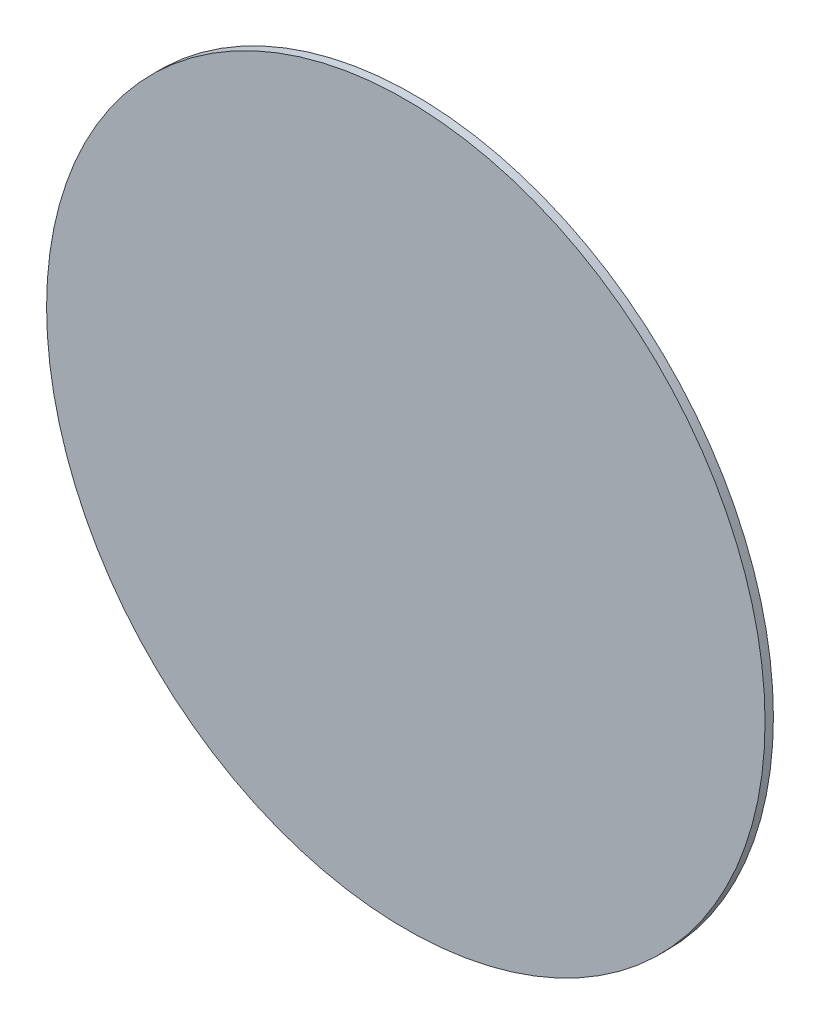
ISO-10303-21;
HEADER;
FILE_DESCRIPTION(('STEP AP214'),'2;1');
FILE_NAME('part.step','',(''),(''),'','','');
FILE_SCHEMA(('AUTOMOTIVE_DESIGN { 1 0 10303 214 1 1 1 1 }'));
ENDSEC;
DATA;
#1=APPLICATION_CONTEXT('core data for automotive mechanical design processes');
#2=APPLICATION_PROTOCOL_DEFINITION('international standard','automotive_design',2000,#1);
#3=PRODUCT_CONTEXT('',#1,'mechanical');
#4=PRODUCT('Part','Part','',(#3));
#5=PRODUCT_RELATED_PRODUCT_CATEGORY('part','',(#4));
#6=PRODUCT_DEFINITION_FORMATION('','',#4);
#7=PRODUCT_DEFINITION_CONTEXT('part definition',#1,'design');
#8=PRODUCT_DEFINITION('design','',#6,#7);
#9=PRODUCT_DEFINITION_SHAPE('','',#8);
#10=(LENGTH_UNIT() NAMED_UNIT(*) SI_UNIT(.MILLI.,.METRE.));
#11=(NAMED_UNIT(*) PLANE_ANGLE_UNIT() SI_UNIT($,.RADIAN.));
#12=(NAMED_UNIT(*) SI_UNIT($,.STERADIAN.) SOLID_ANGLE_UNIT());
#13=UNCERTAINTY_MEASURE_WITH_UNIT(LENGTH_MEASURE(1.E-05),#10,'distance_accuracy_value','');
#14=(GEOMETRIC_REPRESENTATION_CONTEXT(3) GLOBAL_UNCERTAINTY_ASSIGNED_CONTEXT((#13)) GLOBAL_UNIT_ASSIGNED_CONTEXT((#10,
#11,#12)) REPRESENTATION_CONTEXT('',''));
#15=CARTESIAN_POINT('',(0.,0.,0.));
#16=DIRECTION('',(0.,0.,1.));
#17=DIRECTION('',(1.,0.,0.));
#18=AXIS2_PLACEMENT_3D('',#15,#16,#17);
#19=CARTESIAN_POINT('',(0.,0.,2.5));
#20=DIRECTION('',(0.,0.,-1.));
#21=DIRECTION('',(-1.,0.,0.));
#22=AXIS2_PLACEMENT_3D('',#19,#20,#21);
#23=CYLINDRICAL_SURFACE('',#22,107.5);
#24=CARTESIAN_POINT('',(0.,0.,2.5));
#25=DIRECTION('',(0.,0.,1.));
#26=DIRECTION('',(1.,0.,0.));
#27=AXIS2_PLACEMENT_3D('',#24,#25,#26);
#28=CIRCLE('',#27,107.5);
#29=CARTESIAN_POINT('',(107.5,0.,2.5));
#30=VERTEX_POINT('',#29);
#31=EDGE_CURVE('E10',#30,#30,#28,.T.);
#32=ORIENTED_EDGE('',*,*,#31,.F.);
#33=EDGE_LOOP('',(#32));
#34=FACE_BOUND('',#33,.T.);
#35=CARTESIAN_POINT('',(0.,0.,0.));
#36=DIRECTION('',(0.,0.,1.));
#37=DIRECTION('',(1.,0.,0.));
#38=AXIS2_PLACEMENT_3D('',#35,#36,#37);
#39=CIRCLE('',#38,107.5);
#40=CARTESIAN_POINT('',(107.5,0.,0.));
#41=VERTEX_POINT('',#40);
#42=EDGE_CURVE('E35',#41,#41,#39,.T.);
#43=ORIENTED_EDGE('',*,*,#42,.T.);
#44=EDGE_LOOP('',(#43));
#45=FACE_BOUND('',#44,.T.);
#46=ADVANCED_FACE('F32',(#34,#45),#23,.T.);
#47=CARTESIAN_POINT('',(0.,0.,2.5));
#48=DIRECTION('',(0.,0.,1.));
#49=DIRECTION('',(1.,0.,0.));
#50=AXIS2_PLACEMENT_3D('',#47,#48,#49);
#51=PLANE('',#50);
#52=ORIENTED_EDGE('',*,*,#31,.T.);
#53=EDGE_LOOP('',(#52));
#54=FACE_BOUND('',#53,.T.);
#55=ADVANCED_FACE('F47',(#54),#51,.T.);
#56=CARTESIAN_POINT('',(0.,0.,0.));
#57=DIRECTION('',(0.,0.,1.));
#58=DIRECTION('',(1.,0.,0.));
#59=AXIS2_PLACEMENT_3D('',#56,#57,#58);
#60=PLANE('',#59);
#61=ORIENTED_EDGE('',*,*,#42,.F.);
#62=EDGE_LOOP('',(#61));
#63=FACE_BOUND('',#62,.T.);
#64=ADVANCED_FACE('F45',(#63),#60,.F.);
#65=CLOSED_SHELL('',(#46,#55,#64));
#66=MANIFOLD_SOLID_BREP('B2',#65);
#67=ADVANCED_BREP_SHAPE_REPRESENTATION('',(#18,#66),#14);
#68=SHAPE_DEFINITION_REPRESENTATION(#9,#67);
ENDSEC;
END-ISO-10303-21;
